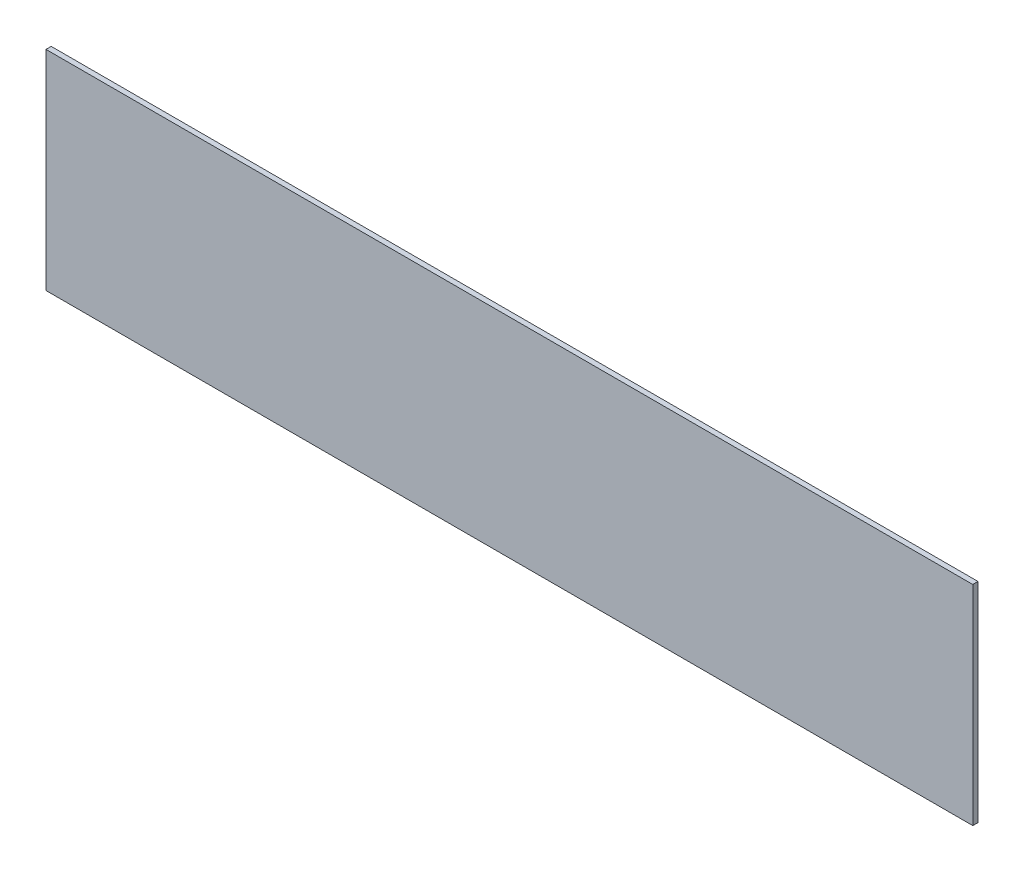
ISO-10303-21;
HEADER;
FILE_DESCRIPTION(('STEP AP214'),'2;1');
FILE_NAME('part.step','',(''),(''),'','','');
FILE_SCHEMA(('AUTOMOTIVE_DESIGN { 1 0 10303 214 1 1 1 1 }'));
ENDSEC;
DATA;
#1=APPLICATION_CONTEXT('core data for automotive mechanical design processes');
#2=APPLICATION_PROTOCOL_DEFINITION('international standard','automotive_design',2000,#1);
#3=PRODUCT_CONTEXT('',#1,'mechanical');
#4=PRODUCT('Part','Part','',(#3));
#5=PRODUCT_RELATED_PRODUCT_CATEGORY('part','',(#4));
#6=PRODUCT_DEFINITION_FORMATION('','',#4);
#7=PRODUCT_DEFINITION_CONTEXT('part definition',#1,'design');
#8=PRODUCT_DEFINITION('design','',#6,#7);
#9=PRODUCT_DEFINITION_SHAPE('','',#8);
#10=(LENGTH_UNIT() NAMED_UNIT(*) SI_UNIT(.MILLI.,.METRE.));
#11=(NAMED_UNIT(*) PLANE_ANGLE_UNIT() SI_UNIT($,.RADIAN.));
#12=(NAMED_UNIT(*) SI_UNIT($,.STERADIAN.) SOLID_ANGLE_UNIT());
#13=UNCERTAINTY_MEASURE_WITH_UNIT(LENGTH_MEASURE(1.E-05),#10,'distance_accuracy_value','');
#14=(GEOMETRIC_REPRESENTATION_CONTEXT(3) GLOBAL_UNCERTAINTY_ASSIGNED_CONTEXT((#13)) GLOBAL_UNIT_ASSIGNED_CONTEXT((#10,
#11,#12)) REPRESENTATION_CONTEXT('',''));
#15=CARTESIAN_POINT('',(0.,0.,0.));
#16=DIRECTION('',(0.,0.,1.));
#17=DIRECTION('',(1.,0.,0.));
#18=AXIS2_PLACEMENT_3D('',#15,#16,#17);
#19=CARTESIAN_POINT('',(177.5,-40.,2.));
#20=DIRECTION('',(-1.,0.,0.));
#21=DIRECTION('',(0.,0.,1.));
#22=AXIS2_PLACEMENT_3D('',#19,#20,#21);
#23=PLANE('',#22);
#24=DIRECTION('',(0.,1.,0.));
#25=VECTOR('',#24,1.);
#26=CARTESIAN_POINT('',(177.5,-40.,0.));
#27=LINE('',#26,#25);
#28=CARTESIAN_POINT('',(177.5,-40.,0.));
#29=VERTEX_POINT('',#28);
#30=CARTESIAN_POINT('',(177.5,40.,0.));
#31=VERTEX_POINT('',#30);
#32=EDGE_CURVE('E107',#29,#31,#27,.T.);
#33=ORIENTED_EDGE('',*,*,#32,.T.);
#34=DIRECTION('',(0.,0.,-1.));
#35=VECTOR('',#34,1.);
#36=CARTESIAN_POINT('',(177.5,40.,2.));
#37=LINE('',#36,#35);
#38=CARTESIAN_POINT('',(177.5,40.,2.));
#39=VERTEX_POINT('',#38);
#40=EDGE_CURVE('E11',#39,#31,#37,.T.);
#41=ORIENTED_EDGE('',*,*,#40,.F.);
#42=DIRECTION('',(0.,1.,0.));
#43=VECTOR('',#42,1.);
#44=CARTESIAN_POINT('',(177.5,-40.,2.));
#45=LINE('',#44,#43);
#46=CARTESIAN_POINT('',(177.5,-40.,2.));
#47=VERTEX_POINT('',#46);
#48=EDGE_CURVE('E91',#47,#39,#45,.T.);
#49=ORIENTED_EDGE('',*,*,#48,.F.);
#50=DIRECTION('',(0.,0.,-1.));
#51=VECTOR('',#50,1.);
#52=CARTESIAN_POINT('',(177.5,-40.,2.));
#53=LINE('',#52,#51);
#54=EDGE_CURVE('E103',#47,#29,#53,.T.);
#55=ORIENTED_EDGE('',*,*,#54,.T.);
#56=EDGE_LOOP('',(#33,#41,#49,#55));
#57=FACE_BOUND('',#56,.T.);
#58=ADVANCED_FACE('F39',(#57),#23,.F.);
#59=CARTESIAN_POINT('',(-177.5,40.,2.));
#60=DIRECTION('',(0.,-1.,0.));
#61=DIRECTION('',(0.,0.,-1.));
#62=AXIS2_PLACEMENT_3D('',#59,#60,#61);
#63=PLANE('',#62);
#64=DIRECTION('',(-1.,0.,0.));
#65=VECTOR('',#64,1.);
#66=CARTESIAN_POINT('',(-177.5,40.,0.));
#67=LINE('',#66,#65);
#68=CARTESIAN_POINT('',(-177.5,40.,0.));
#69=VERTEX_POINT('',#68);
#70=EDGE_CURVE('E96',#31,#69,#67,.T.);
#71=ORIENTED_EDGE('',*,*,#70,.T.);
#72=DIRECTION('',(0.,0.,-1.));
#73=VECTOR('',#72,1.);
#74=CARTESIAN_POINT('',(-177.5,40.,2.));
#75=LINE('',#74,#73);
#76=CARTESIAN_POINT('',(-177.5,40.,2.));
#77=VERTEX_POINT('',#76);
#78=EDGE_CURVE('E48',#77,#69,#75,.T.);
#79=ORIENTED_EDGE('',*,*,#78,.F.);
#80=DIRECTION('',(-1.,0.,0.));
#81=VECTOR('',#80,1.);
#82=CARTESIAN_POINT('',(-177.5,40.,2.));
#83=LINE('',#82,#81);
#84=EDGE_CURVE('E86',#39,#77,#83,.T.);
#85=ORIENTED_EDGE('',*,*,#84,.F.);
#86=ORIENTED_EDGE('',*,*,#40,.T.);
#87=EDGE_LOOP('',(#71,#79,#85,#86));
#88=FACE_BOUND('',#87,.T.);
#89=ADVANCED_FACE('F95',(#88),#63,.F.);
#90=CARTESIAN_POINT('',(-177.5,-40.,2.));
#91=DIRECTION('',(1.,0.,0.));
#92=DIRECTION('',(0.,0.,-1.));
#93=AXIS2_PLACEMENT_3D('',#90,#91,#92);
#94=PLANE('',#93);
#95=DIRECTION('',(0.,-1.,0.));
#96=VECTOR('',#95,1.);
#97=CARTESIAN_POINT('',(-177.5,-40.,0.));
#98=LINE('',#97,#96);
#99=CARTESIAN_POINT('',(-177.5,-40.,0.));
#100=VERTEX_POINT('',#99);
#101=EDGE_CURVE('E73',#69,#100,#98,.T.);
#102=ORIENTED_EDGE('',*,*,#101,.T.);
#103=DIRECTION('',(0.,0.,-1.));
#104=VECTOR('',#103,1.);
#105=CARTESIAN_POINT('',(-177.5,-40.,2.));
#106=LINE('',#105,#104);
#107=CARTESIAN_POINT('',(-177.5,-40.,2.));
#108=VERTEX_POINT('',#107);
#109=EDGE_CURVE('E98',#108,#100,#106,.T.);
#110=ORIENTED_EDGE('',*,*,#109,.F.);
#111=DIRECTION('',(0.,-1.,0.));
#112=VECTOR('',#111,1.);
#113=CARTESIAN_POINT('',(-177.5,-40.,2.));
#114=LINE('',#113,#112);
#115=EDGE_CURVE('E89',#77,#108,#114,.T.);
#116=ORIENTED_EDGE('',*,*,#115,.F.);
#117=ORIENTED_EDGE('',*,*,#78,.T.);
#118=EDGE_LOOP('',(#102,#110,#116,#117));
#119=FACE_BOUND('',#118,.T.);
#120=ADVANCED_FACE('F99',(#119),#94,.F.);
#121=CARTESIAN_POINT('',(-177.5,-40.,2.));
#122=DIRECTION('',(0.,1.,0.));
#123=DIRECTION('',(0.,0.,1.));
#124=AXIS2_PLACEMENT_3D('',#121,#122,#123);
#125=PLANE('',#124);
#126=DIRECTION('',(1.,0.,0.));
#127=VECTOR('',#126,1.);
#128=CARTESIAN_POINT('',(-177.5,-40.,0.));
#129=LINE('',#128,#127);
#130=EDGE_CURVE('E79',#100,#29,#129,.T.);
#131=ORIENTED_EDGE('',*,*,#130,.T.);
#132=ORIENTED_EDGE('',*,*,#54,.F.);
#133=DIRECTION('',(1.,0.,0.));
#134=VECTOR('',#133,1.);
#135=CARTESIAN_POINT('',(-177.5,-40.,2.));
#136=LINE('',#135,#134);
#137=EDGE_CURVE('E56',#108,#47,#136,.T.);
#138=ORIENTED_EDGE('',*,*,#137,.F.);
#139=ORIENTED_EDGE('',*,*,#109,.T.);
#140=EDGE_LOOP('',(#131,#132,#138,#139));
#141=FACE_BOUND('',#140,.T.);
#142=ADVANCED_FACE('F120',(#141),#125,.F.);
#143=CARTESIAN_POINT('',(0.,0.,2.));
#144=DIRECTION('',(0.,0.,-1.));
#145=DIRECTION('',(-1.,0.,0.));
#146=AXIS2_PLACEMENT_3D('',#143,#144,#145);
#147=PLANE('',#146);
#148=ORIENTED_EDGE('',*,*,#48,.T.);
#149=ORIENTED_EDGE('',*,*,#84,.T.);
#150=ORIENTED_EDGE('',*,*,#115,.T.);
#151=ORIENTED_EDGE('',*,*,#137,.T.);
#152=EDGE_LOOP('',(#148,#149,#150,#151));
#153=FACE_BOUND('',#152,.T.);
#154=ADVANCED_FACE('F87',(#153),#147,.F.);
#155=CARTESIAN_POINT('',(0.,0.,0.));
#156=DIRECTION('',(0.,0.,-1.));
#157=DIRECTION('',(-1.,0.,0.));
#158=AXIS2_PLACEMENT_3D('',#155,#156,#157);
#159=PLANE('',#158);
#160=ORIENTED_EDGE('',*,*,#32,.F.);
#161=ORIENTED_EDGE('',*,*,#130,.F.);
#162=ORIENTED_EDGE('',*,*,#101,.F.);
#163=ORIENTED_EDGE('',*,*,#70,.F.);
#164=EDGE_LOOP('',(#160,#161,#162,#163));
#165=FACE_BOUND('',#164,.T.);
#166=ADVANCED_FACE('F123',(#165),#159,.T.);
#167=CLOSED_SHELL('',(#58,#89,#120,#142,#154,#166));
#168=MANIFOLD_SOLID_BREP('B2',#167);
#169=ADVANCED_BREP_SHAPE_REPRESENTATION('',(#18,#168),#14);
#170=SHAPE_DEFINITION_REPRESENTATION(#9,#169);
ENDSEC;
END-ISO-10303-21;
